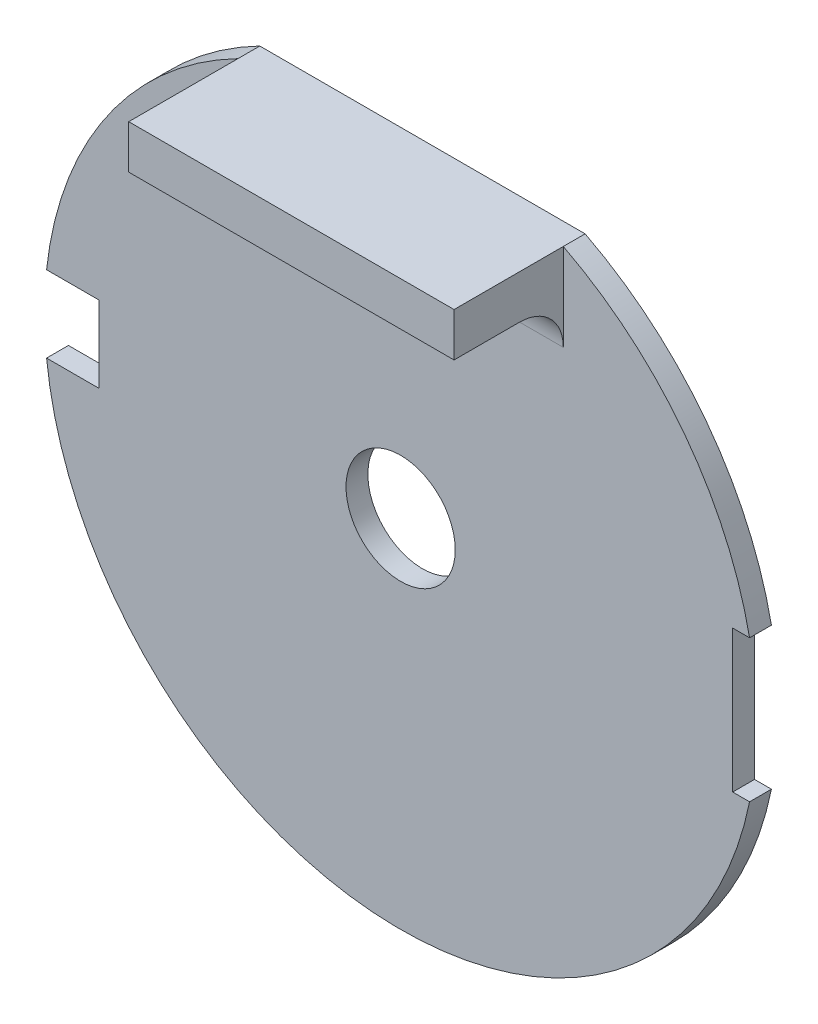
ISO-10303-21;
HEADER;
FILE_DESCRIPTION(('STEP AP214'),'2;1');
FILE_NAME('part.step','',(''),(''),'','','');
FILE_SCHEMA(('AUTOMOTIVE_DESIGN { 1 0 10303 214 1 1 1 1 }'));
ENDSEC;
DATA;
#1=APPLICATION_CONTEXT('core data for automotive mechanical design processes');
#2=APPLICATION_PROTOCOL_DEFINITION('international standard','automotive_design',2000,#1);
#3=PRODUCT_CONTEXT('',#1,'mechanical');
#4=PRODUCT('Part','Part','',(#3));
#5=PRODUCT_RELATED_PRODUCT_CATEGORY('part','',(#4));
#6=PRODUCT_DEFINITION_FORMATION('','',#4);
#7=PRODUCT_DEFINITION_CONTEXT('part definition',#1,'design');
#8=PRODUCT_DEFINITION('design','',#6,#7);
#9=PRODUCT_DEFINITION_SHAPE('','',#8);
#10=(LENGTH_UNIT() NAMED_UNIT(*) SI_UNIT(.MILLI.,.METRE.));
#11=(NAMED_UNIT(*) PLANE_ANGLE_UNIT() SI_UNIT($,.RADIAN.));
#12=(NAMED_UNIT(*) SI_UNIT($,.STERADIAN.) SOLID_ANGLE_UNIT());
#13=UNCERTAINTY_MEASURE_WITH_UNIT(LENGTH_MEASURE(1.E-05),#10,'distance_accuracy_value','');
#14=(GEOMETRIC_REPRESENTATION_CONTEXT(3) GLOBAL_UNCERTAINTY_ASSIGNED_CONTEXT((#13)) GLOBAL_UNIT_ASSIGNED_CONTEXT((#10,
#11,#12)) REPRESENTATION_CONTEXT('',''));
#15=CARTESIAN_POINT('',(0.,0.,0.));
#16=DIRECTION('',(0.,0.,1.));
#17=DIRECTION('',(1.,0.,0.));
#18=AXIS2_PLACEMENT_3D('',#15,#16,#17);
#19=CARTESIAN_POINT('',(0.,0.,1.));
#20=DIRECTION('',(0.,0.,-1.));
#21=DIRECTION('',(-1.,0.,0.));
#22=AXIS2_PLACEMENT_3D('',#19,#20,#21);
#23=CYLINDRICAL_SURFACE('',#22,16.3);
#24=CARTESIAN_POINT('',(0.,0.,0.));
#25=DIRECTION('',(0.,0.,1.));
#26=DIRECTION('',(1.,0.,0.));
#27=AXIS2_PLACEMENT_3D('',#24,#25,#26);
#28=CIRCLE('',#27,16.3);
#29=CARTESIAN_POINT('',(-7.44580418759452,14.5,0.));
#30=VERTEX_POINT('',#29);
#31=CARTESIAN_POINT('',(-16.2057860037704,1.75,0.));
#32=VERTEX_POINT('',#31);
#33=EDGE_CURVE('E245',#30,#32,#28,.T.);
#34=ORIENTED_EDGE('',*,*,#33,.T.);
#35=DIRECTION('',(0.,0.,-1.));
#36=VECTOR('',#35,1.);
#37=CARTESIAN_POINT('',(-16.2057860037704,1.75,1.));
#38=LINE('',#37,#36);
#39=CARTESIAN_POINT('',(-16.2057860037704,1.75,1.));
#40=VERTEX_POINT('',#39);
#41=EDGE_CURVE('E272',#32,#40,#38,.F.);
#42=ORIENTED_EDGE('',*,*,#41,.T.);
#43=CARTESIAN_POINT('',(0.,0.,1.));
#44=DIRECTION('',(0.,0.,1.));
#45=DIRECTION('',(1.,0.,0.));
#46=AXIS2_PLACEMENT_3D('',#43,#44,#45);
#47=CIRCLE('',#46,16.3);
#48=CARTESIAN_POINT('',(-7.44580418759452,14.5,1.));
#49=VERTEX_POINT('',#48);
#50=EDGE_CURVE('E238',#49,#40,#47,.T.);
#51=ORIENTED_EDGE('',*,*,#50,.F.);
#52=DIRECTION('',(0.,0.,-1.));
#53=VECTOR('',#52,1.);
#54=CARTESIAN_POINT('',(-7.44580418759452,14.5,1.));
#55=LINE('',#54,#53);
#56=EDGE_CURVE('E242',#49,#30,#55,.T.);
#57=ORIENTED_EDGE('',*,*,#56,.T.);
#58=EDGE_LOOP('',(#34,#42,#51,#57));
#59=FACE_BOUND('',#58,.T.);
#60=ADVANCED_FACE('F39',(#59),#23,.T.);
#61=CARTESIAN_POINT('',(15.9727111036292,3.25,1.));
#62=VERTEX_POINT('',#61);
#63=CARTESIAN_POINT('',(7.44580418759452,14.5,1.));
#64=VERTEX_POINT('',#63);
#65=EDGE_CURVE('E244',#62,#64,#47,.T.);
#66=ORIENTED_EDGE('',*,*,#65,.F.);
#67=DIRECTION('',(0.,0.,-1.));
#68=VECTOR('',#67,1.);
#69=CARTESIAN_POINT('',(15.9727111036292,3.25,1.));
#70=LINE('',#69,#68);
#71=CARTESIAN_POINT('',(15.9727111036292,3.25,0.));
#72=VERTEX_POINT('',#71);
#73=EDGE_CURVE('E264',#62,#72,#70,.T.);
#74=ORIENTED_EDGE('',*,*,#73,.T.);
#75=CARTESIAN_POINT('',(7.44580418759452,14.5,0.));
#76=VERTEX_POINT('',#75);
#77=EDGE_CURVE('E234',#72,#76,#28,.T.);
#78=ORIENTED_EDGE('',*,*,#77,.T.);
#79=DIRECTION('',(0.,0.,-1.));
#80=VECTOR('',#79,1.);
#81=CARTESIAN_POINT('',(7.44580418759452,14.5,1.));
#82=LINE('',#81,#80);
#83=EDGE_CURVE('E256',#64,#76,#82,.T.);
#84=ORIENTED_EDGE('',*,*,#83,.F.);
#85=EDGE_LOOP('',(#66,#74,#78,#84));
#86=FACE_BOUND('',#85,.T.);
#87=ADVANCED_FACE('F313',(#86),#23,.T.);
#88=CARTESIAN_POINT('',(0.,0.,1.));
#89=DIRECTION('',(0.,0.,1.));
#90=DIRECTION('',(1.,0.,0.));
#91=AXIS2_PLACEMENT_3D('',#88,#89,#90);
#92=PLANE('',#91);
#93=DIRECTION('',(0.,1.,0.));
#94=VECTOR('',#93,1.);
#95=CARTESIAN_POINT('',(7.44580418759452,14.5,1.));
#96=LINE('',#95,#94);
#97=CARTESIAN_POINT('',(7.44580418759452,10.5,1.));
#98=VERTEX_POINT('',#97);
#99=EDGE_CURVE('E55',#98,#64,#96,.T.);
#100=ORIENTED_EDGE('',*,*,#99,.F.);
#101=DIRECTION('',(1.,0.,0.));
#102=VECTOR('',#101,1.);
#103=CARTESIAN_POINT('',(0.,10.5,1.));
#104=LINE('',#103,#102);
#105=CARTESIAN_POINT('',(-7.44580418759452,10.5,1.));
#106=VERTEX_POINT('',#105);
#107=EDGE_CURVE('E279',#98,#106,#104,.F.);
#108=ORIENTED_EDGE('',*,*,#107,.T.);
#109=DIRECTION('',(0.,-1.,0.));
#110=VECTOR('',#109,1.);
#111=CARTESIAN_POINT('',(-7.44580418759452,14.5,1.));
#112=LINE('',#111,#110);
#113=EDGE_CURVE('E62',#49,#106,#112,.T.);
#114=ORIENTED_EDGE('',*,*,#113,.F.);
#115=ORIENTED_EDGE('',*,*,#50,.T.);
#116=DIRECTION('',(-1.,0.,0.));
#117=VECTOR('',#116,1.);
#118=CARTESIAN_POINT('',(-18.8,1.75,1.));
#119=LINE('',#118,#117);
#120=CARTESIAN_POINT('',(-13.8,1.75,1.));
#121=VERTEX_POINT('',#120);
#122=EDGE_CURVE('E181',#121,#40,#119,.T.);
#123=ORIENTED_EDGE('',*,*,#122,.F.);
#124=DIRECTION('',(0.,1.,0.));
#125=VECTOR('',#124,1.);
#126=CARTESIAN_POINT('',(-13.8,1.75,1.));
#127=LINE('',#126,#125);
#128=CARTESIAN_POINT('',(-13.8,-1.75,1.));
#129=VERTEX_POINT('',#128);
#130=EDGE_CURVE('E193',#129,#121,#127,.T.);
#131=ORIENTED_EDGE('',*,*,#130,.F.);
#132=DIRECTION('',(1.,0.,0.));
#133=VECTOR('',#132,1.);
#134=CARTESIAN_POINT('',(-18.8,-1.75,1.));
#135=LINE('',#134,#133);
#136=CARTESIAN_POINT('',(-16.2057860037704,-1.75,1.));
#137=VERTEX_POINT('',#136);
#138=EDGE_CURVE('E190',#137,#129,#135,.T.);
#139=ORIENTED_EDGE('',*,*,#138,.F.);
#140=CARTESIAN_POINT('',(15.9727111036292,-3.25,1.));
#141=VERTEX_POINT('',#140);
#142=EDGE_CURVE('E243',#137,#141,#47,.T.);
#143=ORIENTED_EDGE('',*,*,#142,.T.);
#144=DIRECTION('',(1.,0.,0.));
#145=VECTOR('',#144,1.);
#146=CARTESIAN_POINT('',(15.2,-3.25,1.));
#147=LINE('',#146,#145);
#148=CARTESIAN_POINT('',(15.2,-3.25,1.));
#149=VERTEX_POINT('',#148);
#150=EDGE_CURVE('E170',#149,#141,#147,.T.);
#151=ORIENTED_EDGE('',*,*,#150,.F.);
#152=DIRECTION('',(0.,-1.,0.));
#153=VECTOR('',#152,1.);
#154=CARTESIAN_POINT('',(15.2,3.25,1.));
#155=LINE('',#154,#153);
#156=CARTESIAN_POINT('',(15.2,3.25,1.));
#157=VERTEX_POINT('',#156);
#158=EDGE_CURVE('E165',#157,#149,#155,.T.);
#159=ORIENTED_EDGE('',*,*,#158,.F.);
#160=DIRECTION('',(-1.,0.,0.));
#161=VECTOR('',#160,1.);
#162=CARTESIAN_POINT('',(15.2,3.25,1.));
#163=LINE('',#162,#161);
#164=EDGE_CURVE('E212',#62,#157,#163,.T.);
#165=ORIENTED_EDGE('',*,*,#164,.F.);
#166=ORIENTED_EDGE('',*,*,#65,.T.);
#167=EDGE_LOOP('',(#100,#108,#114,#115,#123,#131,#139,#143,#151,#159,#165,#166));
#168=FACE_BOUND('',#167,.T.);
#169=CARTESIAN_POINT('',(0.,0.,1.));
#170=DIRECTION('',(0.,0.,1.));
#171=DIRECTION('',(1.,0.,0.));
#172=AXIS2_PLACEMENT_3D('',#169,#170,#171);
#173=CIRCLE('',#172,2.5);
#174=CARTESIAN_POINT('',(2.5,0.,1.));
#175=VERTEX_POINT('',#174);
#176=EDGE_CURVE('E230',#175,#175,#173,.T.);
#177=ORIENTED_EDGE('',*,*,#176,.F.);
#178=EDGE_LOOP('',(#177));
#179=FACE_BOUND('',#178,.T.);
#180=ADVANCED_FACE('F288',(#168,#179),#92,.T.);
#181=CARTESIAN_POINT('',(0.,0.,0.));
#182=DIRECTION('',(0.,0.,1.));
#183=DIRECTION('',(1.,0.,0.));
#184=AXIS2_PLACEMENT_3D('',#181,#182,#183);
#185=PLANE('',#184);
#186=DIRECTION('',(0.,1.,0.));
#187=VECTOR('',#186,1.);
#188=CARTESIAN_POINT('',(-13.8,1.75,0.));
#189=LINE('',#188,#187);
#190=CARTESIAN_POINT('',(-13.8,-1.75,0.));
#191=VERTEX_POINT('',#190);
#192=CARTESIAN_POINT('',(-13.8,1.75,0.));
#193=VERTEX_POINT('',#192);
#194=EDGE_CURVE('E180',#191,#193,#189,.T.);
#195=ORIENTED_EDGE('',*,*,#194,.T.);
#196=DIRECTION('',(-1.,0.,0.));
#197=VECTOR('',#196,1.);
#198=CARTESIAN_POINT('',(-18.8,1.75,0.));
#199=LINE('',#198,#197);
#200=EDGE_CURVE('E185',#193,#32,#199,.T.);
#201=ORIENTED_EDGE('',*,*,#200,.T.);
#202=ORIENTED_EDGE('',*,*,#33,.F.);
#203=DIRECTION('',(-1.,0.,0.));
#204=VECTOR('',#203,1.);
#205=CARTESIAN_POINT('',(-7.44580418759452,14.5,0.));
#206=LINE('',#205,#204);
#207=EDGE_CURVE('E249',#76,#30,#206,.T.);
#208=ORIENTED_EDGE('',*,*,#207,.F.);
#209=ORIENTED_EDGE('',*,*,#77,.F.);
#210=DIRECTION('',(-1.,0.,0.));
#211=VECTOR('',#210,1.);
#212=CARTESIAN_POINT('',(15.2,3.25,0.));
#213=LINE('',#212,#211);
#214=CARTESIAN_POINT('',(15.2,3.25,0.));
#215=VERTEX_POINT('',#214);
#216=EDGE_CURVE('E216',#72,#215,#213,.T.);
#217=ORIENTED_EDGE('',*,*,#216,.T.);
#218=DIRECTION('',(0.,-1.,0.));
#219=VECTOR('',#218,1.);
#220=CARTESIAN_POINT('',(15.2,3.25,0.));
#221=LINE('',#220,#219);
#222=CARTESIAN_POINT('',(15.2,-3.25,0.));
#223=VERTEX_POINT('',#222);
#224=EDGE_CURVE('E207',#215,#223,#221,.T.);
#225=ORIENTED_EDGE('',*,*,#224,.T.);
#226=DIRECTION('',(1.,0.,0.));
#227=VECTOR('',#226,1.);
#228=CARTESIAN_POINT('',(15.2,-3.25,0.));
#229=LINE('',#228,#227);
#230=CARTESIAN_POINT('',(15.9727111036292,-3.25,0.));
#231=VERTEX_POINT('',#230);
#232=EDGE_CURVE('E211',#223,#231,#229,.T.);
#233=ORIENTED_EDGE('',*,*,#232,.T.);
#234=CARTESIAN_POINT('',(-16.2057860037704,-1.75,0.));
#235=VERTEX_POINT('',#234);
#236=EDGE_CURVE('E250',#235,#231,#28,.T.);
#237=ORIENTED_EDGE('',*,*,#236,.F.);
#238=DIRECTION('',(1.,0.,0.));
#239=VECTOR('',#238,1.);
#240=CARTESIAN_POINT('',(-18.8,-1.75,0.));
#241=LINE('',#240,#239);
#242=EDGE_CURVE('E176',#235,#191,#241,.T.);
#243=ORIENTED_EDGE('',*,*,#242,.T.);
#244=EDGE_LOOP('',(#195,#201,#202,#208,#209,#217,#225,#233,#237,#243));
#245=FACE_BOUND('',#244,.T.);
#246=CARTESIAN_POINT('',(0.,0.,0.));
#247=DIRECTION('',(0.,0.,1.));
#248=DIRECTION('',(1.,0.,0.));
#249=AXIS2_PLACEMENT_3D('',#246,#247,#248);
#250=CIRCLE('',#249,2.5);
#251=CARTESIAN_POINT('',(2.5,0.,0.));
#252=VERTEX_POINT('',#251);
#253=EDGE_CURVE('E203',#252,#252,#250,.T.);
#254=ORIENTED_EDGE('',*,*,#253,.T.);
#255=EDGE_LOOP('',(#254));
#256=FACE_BOUND('',#255,.T.);
#257=ADVANCED_FACE('F317',(#245,#256),#185,.F.);
#258=ORIENTED_EDGE('',*,*,#142,.F.);
#259=DIRECTION('',(0.,0.,-1.));
#260=VECTOR('',#259,1.);
#261=CARTESIAN_POINT('',(-16.2057860037704,-1.75,1.));
#262=LINE('',#261,#260);
#263=EDGE_CURVE('E268',#137,#235,#262,.T.);
#264=ORIENTED_EDGE('',*,*,#263,.T.);
#265=ORIENTED_EDGE('',*,*,#236,.T.);
#266=DIRECTION('',(0.,0.,-1.));
#267=VECTOR('',#266,1.);
#268=CARTESIAN_POINT('',(15.9727111036292,-3.25,1.));
#269=LINE('',#268,#267);
#270=EDGE_CURVE('E260',#231,#141,#269,.F.);
#271=ORIENTED_EDGE('',*,*,#270,.T.);
#272=EDGE_LOOP('',(#258,#264,#265,#271));
#273=FACE_BOUND('',#272,.T.);
#274=ADVANCED_FACE('F334',(#273),#23,.T.);
#275=CARTESIAN_POINT('',(-7.44580418759452,14.5,1.));
#276=DIRECTION('',(0.,-1.,0.));
#277=DIRECTION('',(0.,0.,-1.));
#278=AXIS2_PLACEMENT_3D('',#275,#276,#277);
#279=PLANE('',#278);
#280=ORIENTED_EDGE('',*,*,#207,.T.);
#281=ORIENTED_EDGE('',*,*,#56,.F.);
#282=DIRECTION('',(0.,0.,-1.));
#283=VECTOR('',#282,1.);
#284=CARTESIAN_POINT('',(-7.44580418759452,14.5,6.));
#285=LINE('',#284,#283);
#286=CARTESIAN_POINT('',(-7.44580418759452,14.5,6.));
#287=VERTEX_POINT('',#286);
#288=EDGE_CURVE('E297',#287,#49,#285,.T.);
#289=ORIENTED_EDGE('',*,*,#288,.F.);
#290=DIRECTION('',(-1.,0.,0.));
#291=VECTOR('',#290,1.);
#292=CARTESIAN_POINT('',(-7.44580418759452,14.5,6.));
#293=LINE('',#292,#291);
#294=CARTESIAN_POINT('',(7.44580418759452,14.5,6.));
#295=VERTEX_POINT('',#294);
#296=EDGE_CURVE('E158',#295,#287,#293,.T.);
#297=ORIENTED_EDGE('',*,*,#296,.F.);
#298=DIRECTION('',(0.,0.,-1.));
#299=VECTOR('',#298,1.);
#300=CARTESIAN_POINT('',(7.44580418759452,14.5,6.));
#301=LINE('',#300,#299);
#302=EDGE_CURVE('E172',#295,#64,#301,.T.);
#303=ORIENTED_EDGE('',*,*,#302,.T.);
#304=ORIENTED_EDGE('',*,*,#83,.T.);
#305=EDGE_LOOP('',(#280,#281,#289,#297,#303,#304));
#306=FACE_BOUND('',#305,.T.);
#307=ADVANCED_FACE('F296',(#306),#279,.F.);
#308=CARTESIAN_POINT('',(0.,0.,1.));
#309=DIRECTION('',(0.,0.,-1.));
#310=DIRECTION('',(-1.,0.,0.));
#311=AXIS2_PLACEMENT_3D('',#308,#309,#310);
#312=CYLINDRICAL_SURFACE('',#311,2.5);
#313=ORIENTED_EDGE('',*,*,#176,.T.);
#314=EDGE_LOOP('',(#313));
#315=FACE_BOUND('',#314,.T.);
#316=ORIENTED_EDGE('',*,*,#253,.F.);
#317=EDGE_LOOP('',(#316));
#318=FACE_BOUND('',#317,.T.);
#319=ADVANCED_FACE('F350',(#315,#318),#312,.F.);
#320=CARTESIAN_POINT('',(15.2,3.25,0.));
#321=DIRECTION('',(0.,1.,0.));
#322=DIRECTION('',(0.,0.,1.));
#323=AXIS2_PLACEMENT_3D('',#320,#321,#322);
#324=PLANE('',#323);
#325=ORIENTED_EDGE('',*,*,#164,.T.);
#326=DIRECTION('',(0.,0.,1.));
#327=VECTOR('',#326,1.);
#328=CARTESIAN_POINT('',(15.2,3.25,0.));
#329=LINE('',#328,#327);
#330=EDGE_CURVE('E194',#215,#157,#329,.T.);
#331=ORIENTED_EDGE('',*,*,#330,.F.);
#332=ORIENTED_EDGE('',*,*,#216,.F.);
#333=ORIENTED_EDGE('',*,*,#73,.F.);
#334=EDGE_LOOP('',(#325,#331,#332,#333));
#335=FACE_BOUND('',#334,.T.);
#336=ADVANCED_FACE('F348',(#335),#324,.F.);
#337=CARTESIAN_POINT('',(15.2,-3.25,0.));
#338=DIRECTION('',(0.,-1.,0.));
#339=DIRECTION('',(0.,0.,-1.));
#340=AXIS2_PLACEMENT_3D('',#337,#338,#339);
#341=PLANE('',#340);
#342=ORIENTED_EDGE('',*,*,#232,.F.);
#343=DIRECTION('',(0.,0.,1.));
#344=VECTOR('',#343,1.);
#345=CARTESIAN_POINT('',(15.2,-3.25,0.));
#346=LINE('',#345,#344);
#347=EDGE_CURVE('E219',#223,#149,#346,.T.);
#348=ORIENTED_EDGE('',*,*,#347,.T.);
#349=ORIENTED_EDGE('',*,*,#150,.T.);
#350=ORIENTED_EDGE('',*,*,#270,.F.);
#351=EDGE_LOOP('',(#342,#348,#349,#350));
#352=FACE_BOUND('',#351,.T.);
#353=ADVANCED_FACE('F343',(#352),#341,.F.);
#354=CARTESIAN_POINT('',(15.2,3.25,0.));
#355=DIRECTION('',(-1.,0.,0.));
#356=DIRECTION('',(0.,0.,1.));
#357=AXIS2_PLACEMENT_3D('',#354,#355,#356);
#358=PLANE('',#357);
#359=ORIENTED_EDGE('',*,*,#158,.T.);
#360=ORIENTED_EDGE('',*,*,#347,.F.);
#361=ORIENTED_EDGE('',*,*,#224,.F.);
#362=ORIENTED_EDGE('',*,*,#330,.T.);
#363=EDGE_LOOP('',(#359,#360,#361,#362));
#364=FACE_BOUND('',#363,.T.);
#365=ADVANCED_FACE('F346',(#364),#358,.F.);
#366=CARTESIAN_POINT('',(-18.8,1.75,0.));
#367=DIRECTION('',(0.,1.,0.));
#368=DIRECTION('',(0.,0.,1.));
#369=AXIS2_PLACEMENT_3D('',#366,#367,#368);
#370=PLANE('',#369);
#371=ORIENTED_EDGE('',*,*,#200,.F.);
#372=DIRECTION('',(0.,0.,1.));
#373=VECTOR('',#372,1.);
#374=CARTESIAN_POINT('',(-13.8,1.75,0.));
#375=LINE('',#374,#373);
#376=EDGE_CURVE('E200',#193,#121,#375,.T.);
#377=ORIENTED_EDGE('',*,*,#376,.T.);
#378=ORIENTED_EDGE('',*,*,#122,.T.);
#379=ORIENTED_EDGE('',*,*,#41,.F.);
#380=EDGE_LOOP('',(#371,#377,#378,#379));
#381=FACE_BOUND('',#380,.T.);
#382=ADVANCED_FACE('F322',(#381),#370,.F.);
#383=CARTESIAN_POINT('',(-18.8,-1.75,0.));
#384=DIRECTION('',(0.,-1.,0.));
#385=DIRECTION('',(0.,0.,-1.));
#386=AXIS2_PLACEMENT_3D('',#383,#384,#385);
#387=PLANE('',#386);
#388=ORIENTED_EDGE('',*,*,#138,.T.);
#389=DIRECTION('',(0.,0.,1.));
#390=VECTOR('',#389,1.);
#391=CARTESIAN_POINT('',(-13.8,-1.75,0.));
#392=LINE('',#391,#390);
#393=EDGE_CURVE('E189',#191,#129,#392,.T.);
#394=ORIENTED_EDGE('',*,*,#393,.F.);
#395=ORIENTED_EDGE('',*,*,#242,.F.);
#396=ORIENTED_EDGE('',*,*,#263,.F.);
#397=EDGE_LOOP('',(#388,#394,#395,#396));
#398=FACE_BOUND('',#397,.T.);
#399=ADVANCED_FACE('F330',(#398),#387,.F.);
#400=CARTESIAN_POINT('',(-13.8,1.75,0.));
#401=DIRECTION('',(1.,0.,0.));
#402=DIRECTION('',(0.,0.,-1.));
#403=AXIS2_PLACEMENT_3D('',#400,#401,#402);
#404=PLANE('',#403);
#405=ORIENTED_EDGE('',*,*,#130,.T.);
#406=ORIENTED_EDGE('',*,*,#376,.F.);
#407=ORIENTED_EDGE('',*,*,#194,.F.);
#408=ORIENTED_EDGE('',*,*,#393,.T.);
#409=EDGE_LOOP('',(#405,#406,#407,#408));
#410=FACE_BOUND('',#409,.T.);
#411=ADVANCED_FACE('F328',(#410),#404,.F.);
#412=CARTESIAN_POINT('',(-7.44580418759452,14.5,6.));
#413=DIRECTION('',(1.,0.,0.));
#414=DIRECTION('',(0.,0.,-1.));
#415=AXIS2_PLACEMENT_3D('',#412,#413,#414);
#416=PLANE('',#415);
#417=ORIENTED_EDGE('',*,*,#113,.T.);
#418=CARTESIAN_POINT('',(-7.44580418759452,10.5,3.));
#419=DIRECTION('',(1.,0.,0.));
#420=DIRECTION('',(0.,0.,-1.));
#421=AXIS2_PLACEMENT_3D('',#418,#419,#420);
#422=CIRCLE('',#421,2.);
#423=CARTESIAN_POINT('',(-7.44580418759452,12.5,3.));
#424=VERTEX_POINT('',#423);
#425=EDGE_CURVE('E11',#106,#424,#422,.T.);
#426=ORIENTED_EDGE('',*,*,#425,.T.);
#427=DIRECTION('',(0.,0.,-1.));
#428=VECTOR('',#427,1.);
#429=CARTESIAN_POINT('',(-7.44580418759452,12.5,6.));
#430=LINE('',#429,#428);
#431=CARTESIAN_POINT('',(-7.44580418759452,12.5,6.));
#432=VERTEX_POINT('',#431);
#433=EDGE_CURVE('E145',#432,#424,#430,.T.);
#434=ORIENTED_EDGE('',*,*,#433,.F.);
#435=DIRECTION('',(0.,-1.,0.));
#436=VECTOR('',#435,1.);
#437=CARTESIAN_POINT('',(-7.44580418759452,14.5,6.));
#438=LINE('',#437,#436);
#439=EDGE_CURVE('E153',#287,#432,#438,.T.);
#440=ORIENTED_EDGE('',*,*,#439,.F.);
#441=ORIENTED_EDGE('',*,*,#288,.T.);
#442=EDGE_LOOP('',(#417,#426,#434,#440,#441));
#443=FACE_BOUND('',#442,.T.);
#444=ADVANCED_FACE('F162',(#443),#416,.F.);
#445=CARTESIAN_POINT('',(-7.44580418759452,12.5,6.));
#446=DIRECTION('',(0.,1.,0.));
#447=DIRECTION('',(0.,0.,1.));
#448=AXIS2_PLACEMENT_3D('',#445,#446,#447);
#449=PLANE('',#448);
#450=ORIENTED_EDGE('',*,*,#433,.T.);
#451=DIRECTION('',(1.,0.,0.));
#452=VECTOR('',#451,1.);
#453=CARTESIAN_POINT('',(-7.44580418759452,12.5,3.));
#454=LINE('',#453,#452);
#455=CARTESIAN_POINT('',(7.44580418759452,12.5,3.));
#456=VERTEX_POINT('',#455);
#457=EDGE_CURVE('E276',#424,#456,#454,.T.);
#458=ORIENTED_EDGE('',*,*,#457,.T.);
#459=DIRECTION('',(0.,0.,-1.));
#460=VECTOR('',#459,1.);
#461=CARTESIAN_POINT('',(7.44580418759452,12.5,6.));
#462=LINE('',#461,#460);
#463=CARTESIAN_POINT('',(7.44580418759452,12.5,6.));
#464=VERTEX_POINT('',#463);
#465=EDGE_CURVE('E148',#464,#456,#462,.T.);
#466=ORIENTED_EDGE('',*,*,#465,.F.);
#467=DIRECTION('',(1.,0.,0.));
#468=VECTOR('',#467,1.);
#469=CARTESIAN_POINT('',(-7.44580418759452,12.5,6.));
#470=LINE('',#469,#468);
#471=EDGE_CURVE('E140',#432,#464,#470,.T.);
#472=ORIENTED_EDGE('',*,*,#471,.F.);
#473=EDGE_LOOP('',(#450,#458,#466,#472));
#474=FACE_BOUND('',#473,.T.);
#475=ADVANCED_FACE('F142',(#474),#449,.F.);
#476=CARTESIAN_POINT('',(7.44580418759452,14.5,6.));
#477=DIRECTION('',(-1.,0.,0.));
#478=DIRECTION('',(0.,0.,1.));
#479=AXIS2_PLACEMENT_3D('',#476,#477,#478);
#480=PLANE('',#479);
#481=ORIENTED_EDGE('',*,*,#99,.T.);
#482=ORIENTED_EDGE('',*,*,#302,.F.);
#483=DIRECTION('',(0.,1.,0.));
#484=VECTOR('',#483,1.);
#485=CARTESIAN_POINT('',(7.44580418759452,14.5,6.));
#486=LINE('',#485,#484);
#487=EDGE_CURVE('E152',#464,#295,#486,.T.);
#488=ORIENTED_EDGE('',*,*,#487,.F.);
#489=ORIENTED_EDGE('',*,*,#465,.T.);
#490=CARTESIAN_POINT('',(7.44580418759452,10.5,3.));
#491=DIRECTION('',(-1.,0.,0.));
#492=DIRECTION('',(0.,0.,1.));
#493=AXIS2_PLACEMENT_3D('',#490,#491,#492);
#494=CIRCLE('',#493,2.);
#495=EDGE_CURVE('E48',#456,#98,#494,.T.);
#496=ORIENTED_EDGE('',*,*,#495,.T.);
#497=EDGE_LOOP('',(#481,#482,#488,#489,#496));
#498=FACE_BOUND('',#497,.T.);
#499=ADVANCED_FACE('F284',(#498),#480,.F.);
#500=CARTESIAN_POINT('',(0.,0.,6.));
#501=DIRECTION('',(0.,0.,1.));
#502=DIRECTION('',(1.,0.,0.));
#503=AXIS2_PLACEMENT_3D('',#500,#501,#502);
#504=PLANE('',#503);
#505=ORIENTED_EDGE('',*,*,#439,.T.);
#506=ORIENTED_EDGE('',*,*,#471,.T.);
#507=ORIENTED_EDGE('',*,*,#487,.T.);
#508=ORIENTED_EDGE('',*,*,#296,.T.);
#509=EDGE_LOOP('',(#505,#506,#507,#508));
#510=FACE_BOUND('',#509,.T.);
#511=ADVANCED_FACE('F156',(#510),#504,.T.);
#512=CARTESIAN_POINT('',(-7.44580418759452,10.5,3.));
#513=DIRECTION('',(1.,0.,0.));
#514=DIRECTION('',(0.,0.,-1.));
#515=AXIS2_PLACEMENT_3D('',#512,#513,#514);
#516=CYLINDRICAL_SURFACE('',#515,2.);
#517=ORIENTED_EDGE('',*,*,#425,.F.);
#518=ORIENTED_EDGE('',*,*,#107,.F.);
#519=ORIENTED_EDGE('',*,*,#495,.F.);
#520=ORIENTED_EDGE('',*,*,#457,.F.);
#521=EDGE_LOOP('',(#517,#518,#519,#520));
#522=FACE_BOUND('',#521,.T.);
#523=ADVANCED_FACE('F41',(#522),#516,.F.);
#524=CLOSED_SHELL('',(#60,#87,#180,#257,#274,#307,#319,#336,#353,#365,#382,#399,#411,#444,#475,
#499,#511,#523));
#525=MANIFOLD_SOLID_BREP('B2',#524);
#526=ADVANCED_BREP_SHAPE_REPRESENTATION('',(#18,#525),#14);
#527=SHAPE_DEFINITION_REPRESENTATION(#9,#526);
ENDSEC;
END-ISO-10303-21;
